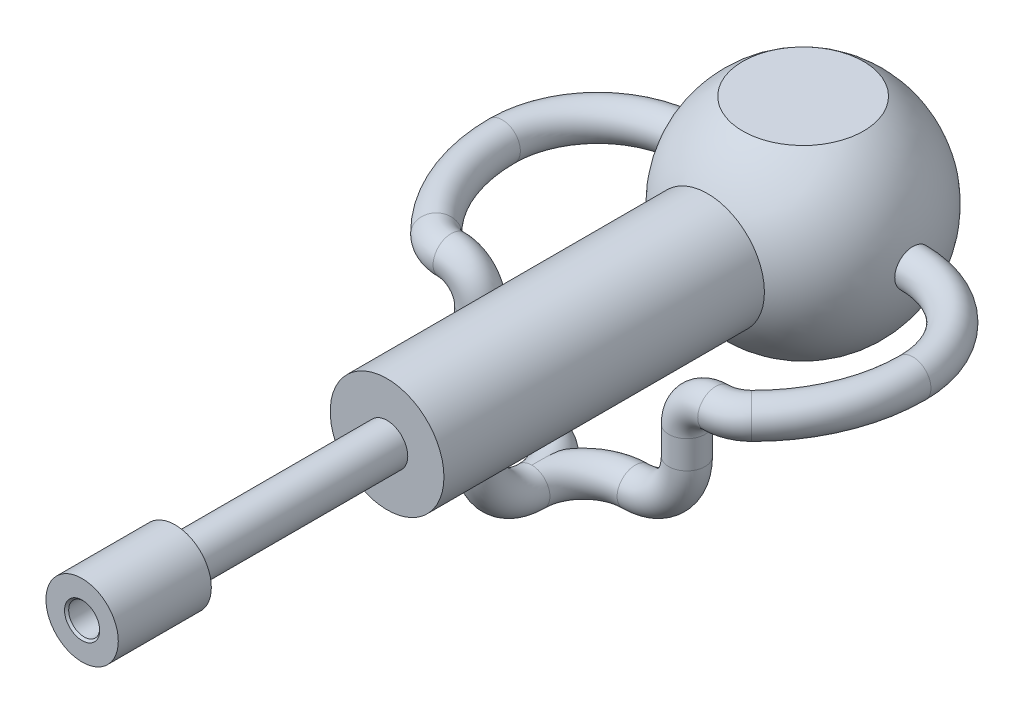
ISO-10303-21;
HEADER;
FILE_DESCRIPTION(('STEP AP214'),'2;1');
FILE_NAME('part.step','',(''),(''),'','','');
FILE_SCHEMA(('AUTOMOTIVE_DESIGN { 1 0 10303 214 1 1 1 1 }'));
ENDSEC;
DATA;
#1=APPLICATION_CONTEXT('core data for automotive mechanical design processes');
#2=APPLICATION_PROTOCOL_DEFINITION('international standard','automotive_design',2000,#1);
#3=PRODUCT_CONTEXT('',#1,'mechanical');
#4=PRODUCT('Part','Part','',(#3));
#5=PRODUCT_RELATED_PRODUCT_CATEGORY('part','',(#4));
#6=PRODUCT_DEFINITION_FORMATION('','',#4);
#7=PRODUCT_DEFINITION_CONTEXT('part definition',#1,'design');
#8=PRODUCT_DEFINITION('design','',#6,#7);
#9=PRODUCT_DEFINITION_SHAPE('','',#8);
#10=(LENGTH_UNIT() NAMED_UNIT(*) SI_UNIT(.MILLI.,.METRE.));
#11=(NAMED_UNIT(*) PLANE_ANGLE_UNIT() SI_UNIT($,.RADIAN.));
#12=(NAMED_UNIT(*) SI_UNIT($,.STERADIAN.) SOLID_ANGLE_UNIT());
#13=UNCERTAINTY_MEASURE_WITH_UNIT(LENGTH_MEASURE(1.E-05),#10,'distance_accuracy_value','');
#14=(GEOMETRIC_REPRESENTATION_CONTEXT(3) GLOBAL_UNCERTAINTY_ASSIGNED_CONTEXT((#13)) GLOBAL_UNIT_ASSIGNED_CONTEXT((#10,
#11,#12)) REPRESENTATION_CONTEXT('',''));
#15=CARTESIAN_POINT('',(0.,0.,0.));
#16=DIRECTION('',(0.,0.,1.));
#17=DIRECTION('',(1.,0.,0.));
#18=AXIS2_PLACEMENT_3D('',#15,#16,#17);
#19=CARTESIAN_POINT('',(1.05064370436022E-07,-0.164460827820359,0.565466681554165));
#20=DIRECTION('',(0.,0.,1.));
#21=DIRECTION('',(1.,0.,0.));
#22=AXIS2_PLACEMENT_3D('',#19,#20,#21);
#23=SPHERICAL_SURFACE('',#22,0.672265625);
#24=CARTESIAN_POINT('',(0.663308615436159,-0.164460827820359,0.565466681554165));
#25=DIRECTION('',(-1.,0.,0.));
#26=DIRECTION('',(0.,0.,1.));
#27=AXIS2_PLACEMENT_3D('',#24,#25,#26);
#28=CIRCLE('',#27,0.109375);
#29=CARTESIAN_POINT('',(0.663308615436159,-0.164460827820359,0.456091681554165));
#30=VERTEX_POINT('',#29);
#31=EDGE_CURVE('E111',#30,#30,#28,.T.);
#32=ORIENTED_EDGE('',*,*,#31,.T.);
#33=EDGE_LOOP('',(#32));
#34=FACE_BOUND('',#33,.T.);
#35=CARTESIAN_POINT('',(-0.663308405307418,-0.164460827820359,0.565466681554165));
#36=DIRECTION('',(1.,0.,0.));
#37=DIRECTION('',(0.,0.,-1.));
#38=AXIS2_PLACEMENT_3D('',#35,#36,#37);
#39=CIRCLE('',#38,0.109375);
#40=CARTESIAN_POINT('',(-0.663308405307418,-0.164460827820359,0.456091681554165));
#41=VERTEX_POINT('',#40);
#42=EDGE_CURVE('E106',#41,#41,#39,.T.);
#43=ORIENTED_EDGE('',*,*,#42,.T.);
#44=EDGE_LOOP('',(#43));
#45=FACE_BOUND('',#44,.T.);
#46=CARTESIAN_POINT('',(1.05064370436022E-07,-0.164460827820359,1.14320105655417));
#47=DIRECTION('',(0.,0.,1.));
#48=DIRECTION('',(1.,0.,0.));
#49=AXIS2_PLACEMENT_3D('',#46,#47,#48);
#50=CIRCLE('',#49,0.34375);
#51=CARTESIAN_POINT('',(0.34375010506437,-0.164460827820359,1.14320105655417));
#52=VERTEX_POINT('',#51);
#53=EDGE_CURVE('E110',#52,#52,#50,.T.);
#54=ORIENTED_EDGE('',*,*,#53,.F.);
#55=EDGE_LOOP('',(#54));
#56=FACE_BOUND('',#55,.T.);
#57=CARTESIAN_POINT('',(1.0506437030215E-07,0.4,0.565466681554165));
#58=DIRECTION('',(0.,1.,0.));
#59=DIRECTION('',(-1.,0.,0.));
#60=AXIS2_PLACEMENT_3D('',#57,#58,#59);
#61=CIRCLE('',#60,0.365137021422089);
#62=CARTESIAN_POINT('',(-0.365136916357718,0.4,0.565466681554165));
#63=VERTEX_POINT('',#62);
#64=EDGE_CURVE('E43',#63,#63,#61,.T.);
#65=ORIENTED_EDGE('',*,*,#64,.F.);
#66=EDGE_LOOP('',(#65));
#67=FACE_BOUND('',#66,.T.);
#68=ADVANCED_FACE('F39',(#34,#45,#56,#67),#23,.T.);
#69=CARTESIAN_POINT('',(1.05064370436022E-07,-0.164460827820359,4.92445105655417));
#70=DIRECTION('',(0.,0.,-1.));
#71=DIRECTION('',(-1.,0.,0.));
#72=AXIS2_PLACEMENT_3D('',#69,#70,#71);
#73=PLANE('',#72);
#74=CARTESIAN_POINT('',(1.05064370436022E-07,-0.164460827820359,4.92445105655417));
#75=DIRECTION('',(0.,0.,-1.));
#76=DIRECTION('',(-1.,0.,0.));
#77=AXIS2_PLACEMENT_3D('',#74,#75,#76);
#78=CIRCLE('',#77,0.106250000000002);
#79=CARTESIAN_POINT('',(-0.106249894935631,-0.164460827820359,4.92445105655417));
#80=VERTEX_POINT('',#79);
#81=EDGE_CURVE('E132',#80,#80,#78,.T.);
#82=ORIENTED_EDGE('',*,*,#81,.T.);
#83=EDGE_LOOP('',(#82));
#84=FACE_BOUND('',#83,.T.);
#85=CARTESIAN_POINT('',(1.05064370436022E-07,-0.164460827820359,4.92445105655417));
#86=DIRECTION('',(0.,0.,1.));
#87=DIRECTION('',(1.,0.,0.));
#88=AXIS2_PLACEMENT_3D('',#85,#86,#87);
#89=CIRCLE('',#88,0.21875);
#90=CARTESIAN_POINT('',(0.21875010506437,-0.164460827820359,4.92445105655417));
#91=VERTEX_POINT('',#90);
#92=EDGE_CURVE('E124',#91,#91,#89,.T.);
#93=ORIENTED_EDGE('',*,*,#92,.T.);
#94=EDGE_LOOP('',(#93));
#95=FACE_BOUND('',#94,.T.);
#96=ADVANCED_FACE('F173',(#84,#95),#73,.F.);
#97=CARTESIAN_POINT('',(1.05064370436022E-07,-0.164460827820359,4.78803672221191));
#98=DIRECTION('',(0.,0.,1.));
#99=DIRECTION('',(1.,0.,0.));
#100=AXIS2_PLACEMENT_3D('',#97,#98,#99);
#101=CYLINDRICAL_SURFACE('',#100,0.21875);
#102=ORIENTED_EDGE('',*,*,#92,.F.);
#103=EDGE_LOOP('',(#102));
#104=FACE_BOUND('',#103,.T.);
#105=CARTESIAN_POINT('',(1.05064370436022E-07,-0.164460827820359,4.36195105655417));
#106=DIRECTION('',(0.,0.,1.));
#107=DIRECTION('',(1.,0.,0.));
#108=AXIS2_PLACEMENT_3D('',#105,#106,#107);
#109=CIRCLE('',#108,0.21875);
#110=CARTESIAN_POINT('',(0.21875010506437,-0.164460827820359,4.36195105655417));
#111=VERTEX_POINT('',#110);
#112=EDGE_CURVE('E121',#111,#111,#109,.T.);
#113=ORIENTED_EDGE('',*,*,#112,.T.);
#114=EDGE_LOOP('',(#113));
#115=FACE_BOUND('',#114,.T.);
#116=ADVANCED_FACE('F180',(#104,#115),#101,.T.);
#117=CARTESIAN_POINT('',(1.05064370436022E-07,0.0542891721796406,4.36195105655417));
#118=DIRECTION('',(0.,0.,1.));
#119=DIRECTION('',(1.,0.,0.));
#120=AXIS2_PLACEMENT_3D('',#117,#118,#119);
#121=PLANE('',#120);
#122=ORIENTED_EDGE('',*,*,#112,.F.);
#123=EDGE_LOOP('',(#122));
#124=FACE_BOUND('',#123,.T.);
#125=CARTESIAN_POINT('',(1.05064370436022E-07,-0.164460827820359,4.36195105655417));
#126=DIRECTION('',(0.,0.,1.));
#127=DIRECTION('',(1.,0.,0.));
#128=AXIS2_PLACEMENT_3D('',#125,#126,#127);
#129=CIRCLE('',#128,0.125);
#130=CARTESIAN_POINT('',(0.12500010506437,-0.164460827820359,4.36195105655417));
#131=VERTEX_POINT('',#130);
#132=EDGE_CURVE('E118',#131,#131,#129,.T.);
#133=ORIENTED_EDGE('',*,*,#132,.T.);
#134=EDGE_LOOP('',(#133));
#135=FACE_BOUND('',#134,.T.);
#136=ADVANCED_FACE('F187',(#124,#135),#121,.F.);
#137=CARTESIAN_POINT('',(1.05064370436022E-07,-0.164460827820359,4.78803672221191));
#138=DIRECTION('',(0.,0.,1.));
#139=DIRECTION('',(1.,0.,0.));
#140=AXIS2_PLACEMENT_3D('',#137,#138,#139);
#141=CYLINDRICAL_SURFACE('',#140,0.125);
#142=ORIENTED_EDGE('',*,*,#132,.F.);
#143=EDGE_LOOP('',(#142));
#144=FACE_BOUND('',#143,.T.);
#145=CARTESIAN_POINT('',(1.05064370436022E-07,-0.164460827820359,3.08070105655416));
#146=DIRECTION('',(0.,0.,1.));
#147=DIRECTION('',(1.,0.,0.));
#148=AXIS2_PLACEMENT_3D('',#145,#146,#147);
#149=CIRCLE('',#148,0.125);
#150=CARTESIAN_POINT('',(0.12500010506437,-0.164460827820359,3.08070105655416));
#151=VERTEX_POINT('',#150);
#152=EDGE_CURVE('E115',#151,#151,#149,.T.);
#153=ORIENTED_EDGE('',*,*,#152,.T.);
#154=EDGE_LOOP('',(#153));
#155=FACE_BOUND('',#154,.T.);
#156=ADVANCED_FACE('F191',(#144,#155),#141,.T.);
#157=CARTESIAN_POINT('',(1.05064370436022E-07,-0.0394608278203594,3.08070105655416));
#158=DIRECTION('',(0.,0.,-1.));
#159=DIRECTION('',(-1.,0.,0.));
#160=AXIS2_PLACEMENT_3D('',#157,#158,#159);
#161=PLANE('',#160);
#162=ORIENTED_EDGE('',*,*,#152,.F.);
#163=EDGE_LOOP('',(#162));
#164=FACE_BOUND('',#163,.T.);
#165=CARTESIAN_POINT('',(1.05064370436022E-07,-0.164460827820359,3.08070105655417));
#166=DIRECTION('',(0.,0.,1.));
#167=DIRECTION('',(1.,0.,0.));
#168=AXIS2_PLACEMENT_3D('',#165,#166,#167);
#169=CIRCLE('',#168,0.34375);
#170=CARTESIAN_POINT('',(0.34375010506437,-0.164460827820359,3.08070105655417));
#171=VERTEX_POINT('',#170);
#172=EDGE_CURVE('E112',#171,#171,#169,.T.);
#173=ORIENTED_EDGE('',*,*,#172,.T.);
#174=EDGE_LOOP('',(#173));
#175=FACE_BOUND('',#174,.T.);
#176=ADVANCED_FACE('F170',(#164,#175),#161,.F.);
#177=CARTESIAN_POINT('',(1.05064370436022E-07,-0.164460827820359,4.78803672221191));
#178=DIRECTION('',(0.,0.,1.));
#179=DIRECTION('',(1.,0.,0.));
#180=AXIS2_PLACEMENT_3D('',#177,#178,#179);
#181=CYLINDRICAL_SURFACE('',#180,0.34375);
#182=CARTESIAN_POINT('',(1.05064370544443E-07,-0.508210827820359,2.62757605655416));
#183=CARTESIAN_POINT('',(0.00598303984569434,-0.508210809314324,2.62757603430133));
#184=CARTESIAN_POINT('',(0.0119662310705951,-0.508053163825251,2.62708353425574));
#185=CARTESIAN_POINT('',(0.0237573004650308,-0.507439751280318,2.62513193991619));
#186=CARTESIAN_POINT('',(0.0295651445347719,-0.506983926623219,2.62367265886206));
#187=CARTESIAN_POINT('',(0.0408337997887642,-0.505823880513206,2.61984193764445));
#188=CARTESIAN_POINT('',(0.0462951438951128,-0.505120051987797,2.61747193984979));
#189=CARTESIAN_POINT('',(0.0567428952640561,-0.503536445929278,2.61189330003404));
#190=CARTESIAN_POINT('',(0.0617292222688804,-0.50265663874079,2.60868451663539));
#191=CARTESIAN_POINT('',(0.0712444445798483,-0.500782866936331,2.60141172726519));
#192=CARTESIAN_POINT('',(0.0757560722031934,-0.499786347936233,2.59732579040216));
#193=CARTESIAN_POINT('',(0.0840429947828927,-0.497806060289349,2.58846135492482));
#194=CARTESIAN_POINT('',(0.0878181462143406,-0.496822294162654,2.58368272163307));
#195=CARTESIAN_POINT('',(0.094619891641243,-0.49495130493495,2.5734174664084));
#196=CARTESIAN_POINT('',(0.0976246813930201,-0.494067224131992,2.56791576970319));
#197=CARTESIAN_POINT('',(0.102659139989088,-0.492534235893732,2.55645245948561));
#198=CARTESIAN_POINT('',(0.104689076447975,-0.491885263928896,2.55049097271597));
#199=CARTESIAN_POINT('',(0.107652594553159,-0.490922738768963,2.53847257980932));
#200=CARTESIAN_POINT('',(0.108618296702573,-0.490599385622248,2.53242440109462));
#201=CARTESIAN_POINT('',(0.109526301464399,-0.490295640876687,2.52024388795449));
#202=CARTESIAN_POINT('',(0.10946888768041,-0.490315154236612,2.51411157732104));
#203=CARTESIAN_POINT('',(0.108357363700124,-0.490686304284026,2.5022047318982));
#204=CARTESIAN_POINT('',(0.10734436936993,-0.49102423952497,2.49642585928572));
#205=CARTESIAN_POINT('',(0.104417212497437,-0.491971854935255,2.48512478217646));
#206=CARTESIAN_POINT('',(0.102502950970303,-0.492581564952824,2.47960260594549));
#207=CARTESIAN_POINT('',(0.0977991357720019,-0.49401433265152,2.46887494498681));
#208=CARTESIAN_POINT('',(0.0949968674972209,-0.494840457162081,2.46367546251914));
#209=CARTESIAN_POINT('',(0.0886054133330968,-0.496611597497984,2.45380717302383));
#210=CARTESIAN_POINT('',(0.0850160167817436,-0.497556645122241,2.44913850856986));
#211=CARTESIAN_POINT('',(0.0769515822805177,-0.499513832459101,2.44023230320584));
#212=CARTESIAN_POINT('',(0.0724426877815944,-0.50052703143577,2.43602559357386));
#213=CARTESIAN_POINT('',(0.0627708579123458,-0.502467026756537,2.42842037284144));
#214=CARTESIAN_POINT('',(0.0576078705186206,-0.503393816217848,2.42502192608826));
#215=CARTESIAN_POINT('',(0.0467134071689632,-0.505066923105735,2.41910777676812));
#216=CARTESIAN_POINT('',(0.040977550955914,-0.505811671672495,2.4165996691189));
#217=CARTESIAN_POINT('',(0.029136086729071,-0.507025444624355,2.41259320241253));
#218=CARTESIAN_POINT('',(0.0230305959450025,-0.507494555927837,2.41109452502373));
#219=CARTESIAN_POINT('',(0.0108846928950979,-0.508090101408693,2.40920253962321));
#220=CARTESIAN_POINT('',(0.00485140340050993,-0.508229461140912,2.40876751467981));
#221=CARTESIAN_POINT('',(-0.00720274933203243,-0.508188172807526,2.40889723836461));
#222=CARTESIAN_POINT('',(-0.0132236143200736,-0.508007573400697,2.40946183497226));
#223=CARTESIAN_POINT('',(-0.0249194840768429,-0.507355164599867,2.41154140643275));
#224=CARTESIAN_POINT('',(-0.0305994090807456,-0.506891030377936,2.41303134966571));
#225=CARTESIAN_POINT('',(-0.0416268922456449,-0.505726157685043,2.41688857644746));
#226=CARTESIAN_POINT('',(-0.0469744088352919,-0.505025389690617,2.41925596947433));
#227=CARTESIAN_POINT('',(-0.0573336100904289,-0.503437332532959,2.42486671903969));
#228=CARTESIAN_POINT('',(-0.062333602160849,-0.502545829733564,2.42813043797291));
#229=CARTESIAN_POINT('',(-0.0717288248223086,-0.500678027708714,2.43541690418187));
#230=CARTESIAN_POINT('',(-0.0761238851305091,-0.499701704732785,2.43943986442462));
#231=CARTESIAN_POINT('',(-0.0843724603848329,-0.497723606046521,2.44832686554566));
#232=CARTESIAN_POINT('',(-0.0881962268779313,-0.496722437499465,2.45321871691878));
#233=CARTESIAN_POINT('',(-0.0949715273059874,-0.494849764698745,2.46359635947694));
#234=CARTESIAN_POINT('',(-0.0979230701349862,-0.493978259122955,2.46908214460485));
#235=CARTESIAN_POINT('',(-0.102852861973881,-0.492473008395913,2.48048389431681));
#236=CARTESIAN_POINT('',(-0.104834457155228,-0.491838447644261,2.48639829797114));
#237=CARTESIAN_POINT('',(-0.107766024821676,-0.490885315618962,2.49850130797762));
#238=CARTESIAN_POINT('',(-0.108716408644071,-0.49056661835572,2.50468980397177));
#239=CARTESIAN_POINT('',(-0.109528335342008,-0.490294751965392,2.51685341382887));
#240=CARTESIAN_POINT('',(-0.109438829524218,-0.490325148924816,2.52282493216092));
#241=CARTESIAN_POINT('',(-0.10829230385966,-0.490707932986846,2.5346633032253));
#242=CARTESIAN_POINT('',(-0.107235332303799,-0.491060304018164,2.54053016116684));
#243=CARTESIAN_POINT('',(-0.104217167482259,-0.492035642875321,2.55190160563404));
#244=CARTESIAN_POINT('',(-0.102270472210648,-0.492654263102148,2.5574104415092));
#245=CARTESIAN_POINT('',(-0.0975396139393377,-0.494091149720119,2.56802766436749));
#246=CARTESIAN_POINT('',(-0.0947552761879226,-0.494909457764055,2.57313596750956));
#247=CARTESIAN_POINT('',(-0.0882968457074477,-0.496694707632584,2.58303033391932));
#248=CARTESIAN_POINT('',(-0.08459138303011,-0.497666314720448,2.58779507612219));
#249=CARTESIAN_POINT('',(-0.0764505032895494,-0.499627761923312,2.59665096857009));
#250=CARTESIAN_POINT('',(-0.0720148881006319,-0.500617606922219,2.60074193538285));
#251=CARTESIAN_POINT('',(-0.062356661304602,-0.502544736563667,2.60827487731381));
#252=CARTESIAN_POINT('',(-0.0571122750792523,-0.503479054068333,2.61168978077238));
#253=CARTESIAN_POINT('',(-0.046094238156847,-0.505151820514681,2.61758517846607));
#254=CARTESIAN_POINT('',(-0.0403207774944798,-0.505890339415765,2.62006600658245));
#255=CARTESIAN_POINT('',(-0.0288490983345537,-0.507042970825001,2.62386267244394));
#256=CARTESIAN_POINT('',(-0.0231768589358052,-0.507477026362722,2.62525106431161));
#257=CARTESIAN_POINT('',(-0.0116697685496835,-0.508060932552662,2.62710766577258));
#258=CARTESIAN_POINT('',(-0.00583495370443864,-0.508210845868994,2.62757607825699));
#259=CARTESIAN_POINT('',(1.05064370544443E-07,-0.508210827820359,2.62757605655416));
#260=B_SPLINE_CURVE_WITH_KNOTS('',3,(#182,#183,#184,#185,#186,#187,#188,#189,#190,#191,#192,
#193,#194,#195,#196,#197,#198,#199,#200,#201,#202,#203,#204,#205,#206,#207,#208,#209,#210,#211,
#212,#213,#214,#215,#216,#217,#218,#219,#220,#221,#222,#223,#224,#225,#226,#227,#228,#229,#230,
#231,#232,#233,#234,#235,#236,#237,#238,#239,#240,#241,#242,#243,#244,#245,#246,#247,#248,#249,
#250,#251,#252,#253,#254,#255,#256,#257,#258,#259),.UNSPECIFIED.,.T.,.F.,(4,2,2,2,2,2,2,2,2,2,2,
2,2,2,2,2,2,2,2,2,2,2,2,2,2,2,2,2,2,2,2,2,2,2,2,2,2,2,4),(0.,0.0179273499031664,
0.0358581639740354,0.0537606959726669,0.071666247396112,0.0900864633618759,0.108510265491847,
0.127408983149715,0.146302509803084,0.164608696220462,0.182909808315975,0.200457745789963,
0.218007610977539,0.235821065993434,0.253639294320338,0.272300201903445,0.29096259461818,
0.309780561168541,0.328592590545441,0.346654046611208,0.364712756160982,0.382303043054482,
0.399895525400373,0.417926494808312,0.43596252943655,0.454741178279767,0.473519635631004,
0.492232845388494,0.510938587933811,0.528767496309064,0.546595514805563,0.564142850268301,
0.581693849055225,0.59995307228384,0.618217258315011,0.637107871799357,0.655991726489083,
0.673479835867995,0.690964088008018),.UNSPECIFIED.);
#261=CARTESIAN_POINT('',(1.0506437049221E-07,-0.50821082782036,2.40882605655416));
#262=VERTEX_POINT('',#261);
#263=CARTESIAN_POINT('',(1.05064370544443E-07,-0.508210827820359,2.62757605655416));
#264=VERTEX_POINT('',#263);
#265=EDGE_CURVE('E135',#262,#264,#260,.T.);
#266=ORIENTED_EDGE('',*,*,#265,.T.);
#267=EDGE_CURVE('E48',#264,#262,#260,.T.);
#268=ORIENTED_EDGE('',*,*,#267,.T.);
#269=EDGE_LOOP('',(#266,#268));
#270=FACE_BOUND('',#269,.T.);
#271=ORIENTED_EDGE('',*,*,#172,.F.);
#272=EDGE_LOOP('',(#271));
#273=FACE_BOUND('',#272,.T.);
#274=ORIENTED_EDGE('',*,*,#53,.T.);
#275=EDGE_LOOP('',(#274));
#276=FACE_BOUND('',#275,.T.);
#277=ADVANCED_FACE('F150',(#270,#273,#276),#181,.T.);
#278=CARTESIAN_POINT('',(1.05064370436022E-07,-0.0394608278203594,3.08070105655416));
#279=DIRECTION('',(0.,0.,-1.));
#280=DIRECTION('',(-1.,0.,0.));
#281=AXIS2_PLACEMENT_3D('',#278,#279,#280);
#282=PLANE('',#281);
#283=CARTESIAN_POINT('',(1.05064370436022E-07,-0.164460827820359,3.08070105655416));
#284=DIRECTION('',(0.,0.,-1.));
#285=DIRECTION('',(-1.,0.,0.));
#286=AXIS2_PLACEMENT_3D('',#283,#284,#285);
#287=CIRCLE('',#286,0.09375);
#288=CARTESIAN_POINT('',(-0.0937498949356296,-0.164460827820359,3.08070105655416));
#289=VERTEX_POINT('',#288);
#290=EDGE_CURVE('E107',#289,#289,#287,.F.);
#291=ORIENTED_EDGE('',*,*,#290,.T.);
#292=EDGE_LOOP('',(#291));
#293=FACE_BOUND('',#292,.T.);
#294=ADVANCED_FACE('F163',(#293),#282,.F.);
#295=CARTESIAN_POINT('',(1.05064370436022E-07,-0.164460827820359,2.81553601360921));
#296=DIRECTION('',(0.,0.,1.));
#297=DIRECTION('',(1.,0.,0.));
#298=AXIS2_PLACEMENT_3D('',#295,#296,#297);
#299=CYLINDRICAL_SURFACE('',#298,0.09375);
#300=CARTESIAN_POINT('',(1.05064370436022E-07,-0.164460827820359,4.91195105655416));
#301=DIRECTION('',(0.,0.,-1.));
#302=DIRECTION('',(-1.,0.,0.));
#303=AXIS2_PLACEMENT_3D('',#300,#301,#302);
#304=CIRCLE('',#303,0.09375);
#305=CARTESIAN_POINT('',(-0.0937498949356296,-0.164460827820359,4.91195105655416));
#306=VERTEX_POINT('',#305);
#307=EDGE_CURVE('E127',#306,#306,#304,.F.);
#308=ORIENTED_EDGE('',*,*,#307,.T.);
#309=EDGE_LOOP('',(#308));
#310=FACE_BOUND('',#309,.T.);
#311=ORIENTED_EDGE('',*,*,#290,.F.);
#312=EDGE_LOOP('',(#311));
#313=FACE_BOUND('',#312,.T.);
#314=ADVANCED_FACE('F161',(#310,#313),#299,.F.);
#315=CARTESIAN_POINT('',(1.05064370436022E-07,-0.164460827820359,4.91195105655416));
#316=DIRECTION('',(0.,0.,1.));
#317=DIRECTION('',(1.,0.,0.));
#318=AXIS2_PLACEMENT_3D('',#315,#316,#317);
#319=CONICAL_SURFACE('',#318,0.09375,0.785398163397451);
#320=ORIENTED_EDGE('',*,*,#81,.F.);
#321=EDGE_LOOP('',(#320));
#322=FACE_BOUND('',#321,.T.);
#323=ORIENTED_EDGE('',*,*,#307,.F.);
#324=EDGE_LOOP('',(#323));
#325=FACE_BOUND('',#324,.T.);
#326=ADVANCED_FACE('F41',(#322,#325),#319,.F.);
#327=CARTESIAN_POINT('',(1.05064370544443E-07,-0.508210827820359,2.20570105655416));
#328=DIRECTION('',(-1.,0.,0.));
#329=DIRECTION('',(0.,0.,1.));
#330=AXIS2_PLACEMENT_3D('',#327,#328,#329);
#331=TOROIDAL_SURFACE('',#330,0.3125,0.109375);
#332=CARTESIAN_POINT('',(1.05064370544443E-07,-0.50821082782036,2.51820105655416));
#333=DIRECTION('',(0.,1.,0.));
#334=DIRECTION('',(1.,0.,0.));
#335=AXIS2_PLACEMENT_3D('',#332,#333,#334);
#336=CIRCLE('',#335,0.109375);
#337=EDGE_CURVE('E54',#262,#264,#336,.T.);
#338=ORIENTED_EDGE('',*,*,#337,.F.);
#339=EDGE_CURVE('E60',#264,#262,#336,.T.);
#340=ORIENTED_EDGE('',*,*,#339,.F.);
#341=EDGE_LOOP('',(#338,#340));
#342=FACE_BOUND('',#341,.T.);
#343=CARTESIAN_POINT('',(1.05064370544443E-07,-0.820710827820359,2.20570105655416));
#344=DIRECTION('',(0.,0.,1.));
#345=DIRECTION('',(1.,0.,0.));
#346=AXIS2_PLACEMENT_3D('',#343,#344,#345);
#347=CIRCLE('',#346,0.109375);
#348=CARTESIAN_POINT('',(1.05064370490232E-07,-0.930085827820359,2.20570105655416));
#349=VERTEX_POINT('',#348);
#350=CARTESIAN_POINT('',(1.05064370490232E-07,-0.711335827820359,2.20570105655416));
#351=VERTEX_POINT('',#350);
#352=EDGE_CURVE('E69',#349,#351,#347,.T.);
#353=ORIENTED_EDGE('',*,*,#352,.T.);
#354=CARTESIAN_POINT('',(1.05064370327602E-07,-0.820710827820359,2.20570105655416));
#355=DIRECTION('',(0.,0.,-1.));
#356=DIRECTION('',(-1.,0.,0.));
#357=AXIS2_PLACEMENT_3D('',#354,#355,#356);
#358=CIRCLE('',#357,0.109375);
#359=EDGE_CURVE('E79',#351,#349,#358,.F.);
#360=ORIENTED_EDGE('',*,*,#359,.T.);
#361=EDGE_LOOP('',(#353,#360));
#362=FACE_BOUND('',#361,.T.);
#363=ADVANCED_FACE('F80',(#342,#362),#331,.T.);
#364=CARTESIAN_POINT('',(0.31250010506437,-0.820710827820359,2.20570105655416));
#365=DIRECTION('',(0.,1.,0.));
#366=DIRECTION('',(0.,0.,1.));
#367=AXIS2_PLACEMENT_3D('',#364,#365,#366);
#368=TOROIDAL_SURFACE('',#367,0.3125,0.109375);
#369=CARTESIAN_POINT('',(1.05064370490232E-07,-0.711335827820359,2.20570105655416));
#370=CARTESIAN_POINT('',(1.05064370491836E-07,-0.711336517213383,2.20275477417994));
#371=CARTESIAN_POINT('',(1.05064370491671E-07,-0.711336262628981,2.19980849658866));
#372=CARTESIAN_POINT('',(1.05064370484041E-07,-0.711334334903013,2.18417977815892));
#373=CARTESIAN_POINT('',(1.05064370454269E-07,-0.711330754147986,2.17149738626135));
#374=CARTESIAN_POINT('',(1.05064370426827E-07,-0.711452820417087,2.14612494579156));
#375=CARTESIAN_POINT('',(1.05064370429175E-07,-0.711578543277819,2.13343489709365));
#376=CARTESIAN_POINT('',(1.05064370389005E-07,-0.71227256880364,2.10805194668773));
#377=CARTESIAN_POINT('',(1.05064370346448E-07,-0.712841255317803,2.09535905205496));
#378=CARTESIAN_POINT('',(1.05064370388354E-07,-0.714866603006251,2.0700472099792));
#379=CARTESIAN_POINT('',(1.05064370472654E-07,-0.716322132035381,2.05742818893172));
#380=CARTESIAN_POINT('',(1.05064370450438E-07,-0.72071951462946,2.03217961241358));
#381=CARTESIAN_POINT('',(1.05064370340181E-07,-0.723689715283137,2.01955462206217));
#382=CARTESIAN_POINT('',(1.05064370367831E-07,-0.731844079703336,1.99506095956259));
#383=CARTESIAN_POINT('',(1.0506437050376E-07,-0.737010333597016,1.98318704288903));
#384=CARTESIAN_POINT('',(1.05064370443551E-07,-0.746486963477968,1.96746612603929));
#385=CARTESIAN_POINT('',(1.05064370392544E-07,-0.749606199489989,1.96290213837501));
#386=CARTESIAN_POINT('',(1.05064370398943E-07,-0.75643683895736,1.95422600325332));
#387=CARTESIAN_POINT('',(1.05064370456443E-07,-0.76014875567088,1.95011425269102));
#388=CARTESIAN_POINT('',(1.05064370466914E-07,-0.768217633472304,1.94248381944982));
#389=CARTESIAN_POINT('',(1.05064370418846E-07,-0.772580609576911,1.93897140273746));
#390=CARTESIAN_POINT('',(1.05064370426363E-07,-0.781878771714722,1.93280953063883));
#391=CARTESIAN_POINT('',(1.05064370481746E-07,-0.786812827470623,1.93015840889294));
#392=CARTESIAN_POINT('',(1.05064370446296E-07,-0.795905549881156,1.92642893259219));
#393=CARTESIAN_POINT('',(1.05064370386849E-07,-0.799972879242576,1.92512716112027));
#394=CARTESIAN_POINT('',(1.05064370388826E-07,-0.808269128578567,1.92322568746526));
#395=CARTESIAN_POINT('',(1.0506437045019E-07,-0.812497966192426,1.92262563225259));
#396=CARTESIAN_POINT('',(1.05064370473136E-07,-0.82100321102857,1.92216635912771));
#397=CARTESIAN_POINT('',(1.05064370434548E-07,-0.825279686930362,1.92230840310088));
#398=CARTESIAN_POINT('',(1.05064370433756E-07,-0.833743892771172,1.92332646517129));
#399=CARTESIAN_POINT('',(1.05064370471563E-07,-0.837931610673106,1.92420258217645));
#400=CARTESIAN_POINT('',(1.05064370451942E-07,-0.846021100093849,1.92660863736791));
#401=CARTESIAN_POINT('',(1.05064370396404E-07,-0.849926915502781,1.92812514839519));
#402=CARTESIAN_POINT('',(1.05064370394146E-07,-0.857464347857287,1.93172781446775));
#403=CARTESIAN_POINT('',(1.05064370447468E-07,-0.861095856432625,1.93381419316325));
#404=CARTESIAN_POINT('',(1.05064370481197E-07,-0.86934924295656,1.93934534197185));
#405=CARTESIAN_POINT('',(1.05064370426446E-07,-0.873826950635668,1.94300551806781));
#406=CARTESIAN_POINT('',(1.05064370414562E-07,-0.882128268513786,1.95100349603088));
#407=CARTESIAN_POINT('',(1.05064370457615E-07,-0.885950620258294,1.95534257168393));
#408=CARTESIAN_POINT('',(1.05064370467463E-07,-0.894496576656854,1.96651337299823));
#409=CARTESIAN_POINT('',(1.05064370392533E-07,-0.89888025491693,1.97360371521713));
#410=CARTESIAN_POINT('',(1.05064370377445E-07,-0.906494687071849,1.98836823932578));
#411=CARTESIAN_POINT('',(1.05064370437499E-07,-0.909723612591712,1.99604332396611));
#412=CARTESIAN_POINT('',(1.05064370515074E-07,-0.918582678750302,2.02120952999154));
#413=CARTESIAN_POINT('',(1.05064370392882E-07,-0.922381531726188,2.03932592943666));
#414=CARTESIAN_POINT('',(1.05064370359101E-07,-0.927396153209426,2.07589256909272));
#415=CARTESIAN_POINT('',(1.0506437044883E-07,-0.928595654714044,2.09434418708704));
#416=CARTESIAN_POINT('',(1.05064370471388E-07,-0.929742893168675,2.12683029591982));
#417=CARTESIAN_POINT('',(1.05064370436797E-07,-0.929922509418737,2.14085847375176));
#418=CARTESIAN_POINT('',(1.05064370412458E-07,-0.930094845888898,2.16887843910734));
#419=CARTESIAN_POINT('',(1.05064370422598E-07,-0.930088036588094,2.18287022913147));
#420=CARTESIAN_POINT('',(1.05064370469877E-07,-0.93008527628976,2.19980848889303));
#421=CARTESIAN_POINT('',(1.05064370479383E-07,-0.930084996976059,2.20275476498129));
#422=CARTESIAN_POINT('',(1.05064370490232E-07,-0.930085827820359,2.20570105655416));
#423=B_SPLINE_CURVE_WITH_KNOTS('',3,(#369,#370,#371,#372,#373,#374,#375,#376,#377,#378,#379,
#380,#381,#382,#383,#384,#385,#386,#387,#388,#389,#390,#391,#392,#393,#394,#395,#396,#397,#398,
#399,#400,#401,#402,#403,#404,#405,#406,#407,#408,#409,#410,#411,#412,#413,#414,#415,#416,#417,
#418,#419,#420,#421,#422),.UNSPECIFIED.,.F.,.F.,(4,2,2,2,2,2,2,2,2,2,2,2,2,2,2,2,2,2,2,2,2,2,2,
2,2,2,4),(0.,0.00883883476512046,0.0468862102823564,0.0849559133276915,0.123058642331658,
0.161112830925739,0.199906872900712,0.238390424018514,0.254934723738751,0.271493429221584,
0.288215859695346,0.304905741662187,0.317661952430154,0.330411742854108,0.343183220413016,
0.355956419058516,0.368474148379469,0.380996797483629,0.398250476898998,0.415536925573206,
0.440404577920303,0.465311431877684,0.520398274541947,0.575828872453329,0.617911201972519,
0.659887338821181,0.668726173586301),.UNSPECIFIED.);
#424=EDGE_CURVE('E11',#351,#349,#423,.T.);
#425=ORIENTED_EDGE('',*,*,#424,.F.);
#426=ORIENTED_EDGE('',*,*,#352,.F.);
#427=EDGE_LOOP('',(#425,#426));
#428=FACE_BOUND('',#427,.T.);
#429=CARTESIAN_POINT('',(0.31250010506437,-0.820710827820359,1.89320105655417));
#430=DIRECTION('',(-1.,0.,0.));
#431=DIRECTION('',(0.,0.,1.));
#432=AXIS2_PLACEMENT_3D('',#429,#430,#431);
#433=CIRCLE('',#432,0.109375);
#434=CARTESIAN_POINT('',(0.31250010506437,-0.93008582782036,1.89320105655417));
#435=VERTEX_POINT('',#434);
#436=EDGE_CURVE('E74',#435,#435,#433,.T.);
#437=ORIENTED_EDGE('',*,*,#436,.T.);
#438=EDGE_LOOP('',(#437));
#439=FACE_BOUND('',#438,.T.);
#440=ADVANCED_FACE('F70',(#428,#439),#368,.T.);
#441=CARTESIAN_POINT('',(0.31250010506437,-0.50821082782036,1.89320105655417));
#442=DIRECTION('',(0.,0.,-1.));
#443=DIRECTION('',(-1.,0.,0.));
#444=AXIS2_PLACEMENT_3D('',#441,#442,#443);
#445=TOROIDAL_SURFACE('',#444,0.3125,0.109375);
#446=CARTESIAN_POINT('',(0.625000105064371,-0.50821082782036,1.89320105655417));
#447=DIRECTION('',(0.,-1.,0.));
#448=DIRECTION('',(0.,0.,1.));
#449=AXIS2_PLACEMENT_3D('',#446,#447,#448);
#450=CIRCLE('',#449,0.109375);
#451=CARTESIAN_POINT('',(0.73437510506437,-0.50821082782036,1.89320105655417));
#452=VERTEX_POINT('',#451);
#453=EDGE_CURVE('E100',#452,#452,#450,.T.);
#454=CARTESIAN_POINT('',(0.31250010506437,-0.50821082782036,1.89320105655417));
#455=DIRECTION('',(0.,0.,-1.));
#456=DIRECTION('',(-1.,0.,0.));
#457=AXIS2_PLACEMENT_3D('',#454,#455,#456);
#458=CIRCLE('',#457,0.421875);
#459=EDGE_CURVE('',#452,#435,#458,.T.);
#460=ORIENTED_EDGE('',*,*,#453,.T.);
#461=ORIENTED_EDGE('',*,*,#436,.F.);
#462=ORIENTED_EDGE('',*,*,#459,.T.);
#463=ORIENTED_EDGE('',*,*,#459,.F.);
#464=EDGE_LOOP('',(#460,#462,#461,#463));
#465=FACE_BOUND('',#464,.T.);
#466=ADVANCED_FACE('F282',(#465),#445,.T.);
#467=CARTESIAN_POINT('',(0.625000105064371,-0.33946082782036,1.89320105655417));
#468=DIRECTION('',(0.,-1.,0.));
#469=DIRECTION('',(0.,0.,-1.));
#470=AXIS2_PLACEMENT_3D('',#467,#468,#469);
#471=CYLINDRICAL_SURFACE('',#470,0.109375);
#472=ORIENTED_EDGE('',*,*,#453,.F.);
#473=EDGE_LOOP('',(#472));
#474=FACE_BOUND('',#473,.T.);
#475=CARTESIAN_POINT('',(0.625000105064371,-0.33946082782036,1.89320105655417));
#476=DIRECTION('',(0.,-1.,0.));
#477=DIRECTION('',(0.,0.,1.));
#478=AXIS2_PLACEMENT_3D('',#475,#476,#477);
#479=CIRCLE('',#478,0.109375);
#480=CARTESIAN_POINT('',(0.515625105064371,-0.33946082782036,1.89320105655417));
#481=VERTEX_POINT('',#480);
#482=EDGE_CURVE('E97',#481,#481,#479,.T.);
#483=ORIENTED_EDGE('',*,*,#482,.T.);
#484=EDGE_LOOP('',(#483));
#485=FACE_BOUND('',#484,.T.);
#486=ADVANCED_FACE('F278',(#474,#485),#471,.T.);
#487=CARTESIAN_POINT('',(0.800000105064371,-0.33946082782036,1.89320105655417));
#488=DIRECTION('',(0.,0.,1.));
#489=DIRECTION('',(1.,0.,0.));
#490=AXIS2_PLACEMENT_3D('',#487,#488,#489);
#491=TOROIDAL_SURFACE('',#490,0.175,0.109375);
#492=CARTESIAN_POINT('',(0.800000105064371,-0.164460827820359,1.89320105655417));
#493=DIRECTION('',(-1.,0.,0.));
#494=DIRECTION('',(0.,0.,1.));
#495=AXIS2_PLACEMENT_3D('',#492,#493,#494);
#496=CIRCLE('',#495,0.109375);
#497=CARTESIAN_POINT('',(0.800000105064371,-0.0550858278203596,1.89320105655417));
#498=VERTEX_POINT('',#497);
#499=EDGE_CURVE('E94',#498,#498,#496,.T.);
#500=CARTESIAN_POINT('',(0.800000105064371,-0.33946082782036,1.89320105655417));
#501=DIRECTION('',(0.,0.,1.));
#502=DIRECTION('',(1.,0.,0.));
#503=AXIS2_PLACEMENT_3D('',#500,#501,#502);
#504=CIRCLE('',#503,0.284375);
#505=EDGE_CURVE('',#498,#481,#504,.T.);
#506=ORIENTED_EDGE('',*,*,#499,.T.);
#507=ORIENTED_EDGE('',*,*,#482,.F.);
#508=ORIENTED_EDGE('',*,*,#505,.T.);
#509=ORIENTED_EDGE('',*,*,#505,.F.);
#510=EDGE_LOOP('',(#506,#508,#507,#509));
#511=FACE_BOUND('',#510,.T.);
#512=ADVANCED_FACE('F274',(#511),#491,.T.);
#513=CARTESIAN_POINT('',(0.800000105064371,-0.164460827820359,1.67445105655416));
#514=DIRECTION('',(0.,-1.,0.));
#515=DIRECTION('',(0.,0.,-1.));
#516=AXIS2_PLACEMENT_3D('',#513,#514,#515);
#517=TOROIDAL_SURFACE('',#516,0.21875,0.109375);
#518=ORIENTED_EDGE('',*,*,#499,.F.);
#519=EDGE_LOOP('',(#518));
#520=FACE_BOUND('',#519,.T.);
#521=CARTESIAN_POINT('',(0.953563048093194,-0.164460827820359,1.83023932642172));
#522=DIRECTION('',(-0.71217494796597,0.,0.70200202527462));
#523=DIRECTION('',(0.702002025274619,0.,0.71217494796597));
#524=AXIS2_PLACEMENT_3D('',#521,#522,#523);
#525=CIRCLE('',#524,0.109375);
#526=CARTESIAN_POINT('',(1.03034451960761,-0.164460827820359,1.9081334613555));
#527=VERTEX_POINT('',#526);
#528=EDGE_CURVE('E85',#527,#527,#525,.T.);
#529=ORIENTED_EDGE('',*,*,#528,.T.);
#530=EDGE_LOOP('',(#529));
#531=FACE_BOUND('',#530,.T.);
#532=ADVANCED_FACE('F270',(#520,#531),#517,.T.);
#533=CARTESIAN_POINT('',(0.276338640992538,-0.164460827820359,1.14320105655417));
#534=DIRECTION('',(0.,-1.,0.));
#535=DIRECTION('',(0.,0.,-1.));
#536=AXIS2_PLACEMENT_3D('',#533,#534,#535);
#537=TOROIDAL_SURFACE('',#536,0.964704349443621,0.109375);
#538=CARTESIAN_POINT('',(1.24104299043616,-0.164460827820359,1.14320105655417));
#539=DIRECTION('',(0.,0.,1.));
#540=DIRECTION('',(1.,0.,0.));
#541=AXIS2_PLACEMENT_3D('',#538,#539,#540);
#542=CIRCLE('',#541,0.109375);
#543=CARTESIAN_POINT('',(1.35041799043616,-0.164460827820359,1.14320105655417));
#544=VERTEX_POINT('',#543);
#545=EDGE_CURVE('E81',#544,#544,#542,.T.);
#546=CARTESIAN_POINT('',(0.276338640992538,-0.164460827820359,1.14320105655417));
#547=DIRECTION('',(0.,-1.,0.));
#548=DIRECTION('',(0.,0.,-1.));
#549=AXIS2_PLACEMENT_3D('',#546,#547,#548);
#550=CIRCLE('',#549,1.07407934944362);
#551=EDGE_CURVE('',#544,#527,#550,.T.);
#552=ORIENTED_EDGE('',*,*,#545,.T.);
#553=ORIENTED_EDGE('',*,*,#528,.F.);
#554=ORIENTED_EDGE('',*,*,#551,.T.);
#555=ORIENTED_EDGE('',*,*,#551,.F.);
#556=EDGE_LOOP('',(#552,#554,#553,#555));
#557=FACE_BOUND('',#556,.T.);
#558=ADVANCED_FACE('F266',(#557),#537,.T.);
#559=CARTESIAN_POINT('',(0.663308615436159,-0.164460827820359,1.14320105655417));
#560=DIRECTION('',(0.,-1.,0.));
#561=DIRECTION('',(0.,0.,-1.));
#562=AXIS2_PLACEMENT_3D('',#559,#560,#561);
#563=TOROIDAL_SURFACE('',#562,0.577734375,0.109375);
#564=CARTESIAN_POINT('',(0.663308615436159,-0.164460827820359,1.14320105655417));
#565=DIRECTION('',(0.,-1.,0.));
#566=DIRECTION('',(0.,0.,-1.));
#567=AXIS2_PLACEMENT_3D('',#564,#565,#566);
#568=CIRCLE('',#567,0.687109375);
#569=EDGE_CURVE('',#30,#544,#568,.T.);
#570=ORIENTED_EDGE('',*,*,#31,.F.);
#571=ORIENTED_EDGE('',*,*,#545,.F.);
#572=ORIENTED_EDGE('',*,*,#569,.T.);
#573=ORIENTED_EDGE('',*,*,#569,.F.);
#574=EDGE_LOOP('',(#570,#572,#571,#573));
#575=FACE_BOUND('',#574,.T.);
#576=ADVANCED_FACE('F263',(#575),#563,.T.);
#577=CARTESIAN_POINT('',(1.05064370544443E-07,-0.50821082782036,2.51820105655416));
#578=DIRECTION('',(0.,1.,0.));
#579=DIRECTION('',(0.,0.,1.));
#580=AXIS2_PLACEMENT_3D('',#577,#578,#579);
#581=CYLINDRICAL_SURFACE('',#580,0.109375);
#582=ORIENTED_EDGE('',*,*,#265,.F.);
#583=ORIENTED_EDGE('',*,*,#337,.T.);
#584=EDGE_LOOP('',(#582,#583));
#585=FACE_BOUND('',#584,.T.);
#586=ADVANCED_FACE('F160',(#585),#581,.T.);
#587=ORIENTED_EDGE('',*,*,#267,.F.);
#588=ORIENTED_EDGE('',*,*,#339,.T.);
#589=EDGE_LOOP('',(#587,#588));
#590=FACE_BOUND('',#589,.T.);
#591=ADVANCED_FACE('F154',(#590),#581,.T.);
#592=CARTESIAN_POINT('',(-0.663308405307418,-0.164460827820359,1.14320105655417));
#593=DIRECTION('',(0.,1.,0.));
#594=DIRECTION('',(0.,0.,1.));
#595=AXIS2_PLACEMENT_3D('',#592,#593,#594);
#596=TOROIDAL_SURFACE('',#595,0.577734375,0.109375);
#597=CARTESIAN_POINT('',(-1.24104278030742,-0.164460827820359,1.14320105655417));
#598=DIRECTION('',(0.,0.,-1.));
#599=DIRECTION('',(-1.,0.,0.));
#600=AXIS2_PLACEMENT_3D('',#597,#598,#599);
#601=CIRCLE('',#600,0.109375);
#602=CARTESIAN_POINT('',(-1.35041778030742,-0.164460827820359,1.14320105655417));
#603=VERTEX_POINT('',#602);
#604=EDGE_CURVE('E210',#603,#603,#601,.F.);
#605=CARTESIAN_POINT('',(-0.663308405307418,-0.164460827820359,1.14320105655417));
#606=DIRECTION('',(0.,1.,0.));
#607=DIRECTION('',(0.,0.,1.));
#608=AXIS2_PLACEMENT_3D('',#605,#606,#607);
#609=CIRCLE('',#608,0.687109375);
#610=EDGE_CURVE('',#41,#603,#609,.T.);
#611=ORIENTED_EDGE('',*,*,#42,.F.);
#612=ORIENTED_EDGE('',*,*,#604,.F.);
#613=ORIENTED_EDGE('',*,*,#610,.T.);
#614=ORIENTED_EDGE('',*,*,#610,.F.);
#615=EDGE_LOOP('',(#611,#613,#612,#614));
#616=FACE_BOUND('',#615,.T.);
#617=ADVANCED_FACE('F159',(#616),#596,.T.);
#618=CARTESIAN_POINT('',(-0.276338430863797,-0.164460827820359,1.14320105655417));
#619=DIRECTION('',(0.,1.,0.));
#620=DIRECTION('',(0.,0.,1.));
#621=AXIS2_PLACEMENT_3D('',#618,#619,#620);
#622=TOROIDAL_SURFACE('',#621,0.964704349443621,0.109375);
#623=CARTESIAN_POINT('',(-0.953562837964453,-0.164460827820359,1.83023932642172));
#624=DIRECTION('',(-0.71217494796597,0.,-0.70200202527462));
#625=DIRECTION('',(-0.702002025274619,0.,0.71217494796597));
#626=AXIS2_PLACEMENT_3D('',#623,#624,#625);
#627=CIRCLE('',#626,0.109375);
#628=CARTESIAN_POINT('',(-1.03034430947886,-0.164460827820359,1.9081334613555));
#629=VERTEX_POINT('',#628);
#630=EDGE_CURVE('E212',#629,#629,#627,.F.);
#631=CARTESIAN_POINT('',(-0.276338430863797,-0.164460827820359,1.14320105655417));
#632=DIRECTION('',(0.,1.,0.));
#633=DIRECTION('',(0.,0.,1.));
#634=AXIS2_PLACEMENT_3D('',#631,#632,#633);
#635=CIRCLE('',#634,1.07407934944362);
#636=EDGE_CURVE('',#603,#629,#635,.T.);
#637=ORIENTED_EDGE('',*,*,#604,.T.);
#638=ORIENTED_EDGE('',*,*,#630,.F.);
#639=ORIENTED_EDGE('',*,*,#636,.T.);
#640=ORIENTED_EDGE('',*,*,#636,.F.);
#641=EDGE_LOOP('',(#637,#639,#638,#640));
#642=FACE_BOUND('',#641,.T.);
#643=ADVANCED_FACE('F244',(#642),#622,.T.);
#644=CARTESIAN_POINT('',(-0.79999989493563,-0.164460827820359,1.67445105655416));
#645=DIRECTION('',(0.,1.,0.));
#646=DIRECTION('',(0.,0.,1.));
#647=AXIS2_PLACEMENT_3D('',#644,#645,#646);
#648=TOROIDAL_SURFACE('',#647,0.21875,0.109375);
#649=CARTESIAN_POINT('',(-0.79999989493563,-0.164460827820359,1.89320105655417));
#650=DIRECTION('',(-1.,0.,0.));
#651=DIRECTION('',(0.,0.,1.));
#652=AXIS2_PLACEMENT_3D('',#649,#650,#651);
#653=CIRCLE('',#652,0.109375);
#654=CARTESIAN_POINT('',(-0.79999989493563,-0.164460827820359,2.00257605655416));
#655=VERTEX_POINT('',#654);
#656=EDGE_CURVE('E217',#655,#655,#653,.F.);
#657=CARTESIAN_POINT('',(-0.79999989493563,-0.164460827820359,1.67445105655416));
#658=DIRECTION('',(0.,1.,0.));
#659=DIRECTION('',(0.,0.,1.));
#660=AXIS2_PLACEMENT_3D('',#657,#658,#659);
#661=CIRCLE('',#660,0.328125);
#662=EDGE_CURVE('',#629,#655,#661,.T.);
#663=ORIENTED_EDGE('',*,*,#630,.T.);
#664=ORIENTED_EDGE('',*,*,#656,.F.);
#665=ORIENTED_EDGE('',*,*,#662,.T.);
#666=ORIENTED_EDGE('',*,*,#662,.F.);
#667=EDGE_LOOP('',(#663,#665,#664,#666));
#668=FACE_BOUND('',#667,.T.);
#669=ADVANCED_FACE('F238',(#668),#648,.T.);
#670=CARTESIAN_POINT('',(-0.79999989493563,-0.33946082782036,1.89320105655417));
#671=DIRECTION('',(0.,0.,-1.));
#672=DIRECTION('',(-1.,0.,0.));
#673=AXIS2_PLACEMENT_3D('',#670,#671,#672);
#674=TOROIDAL_SURFACE('',#673,0.175,0.109375);
#675=CARTESIAN_POINT('',(-0.62499989493563,-0.33946082782036,1.89320105655417));
#676=DIRECTION('',(0.,1.,0.));
#677=DIRECTION('',(0.,0.,1.));
#678=AXIS2_PLACEMENT_3D('',#675,#676,#677);
#679=CIRCLE('',#678,0.109375);
#680=CARTESIAN_POINT('',(-0.62499989493563,-0.33946082782036,2.00257605655416));
#681=VERTEX_POINT('',#680);
#682=EDGE_CURVE('E222',#681,#681,#679,.F.);
#683=ORIENTED_EDGE('',*,*,#682,.F.);
#684=EDGE_LOOP('',(#683));
#685=FACE_BOUND('',#684,.T.);
#686=ORIENTED_EDGE('',*,*,#656,.T.);
#687=EDGE_LOOP('',(#686));
#688=FACE_BOUND('',#687,.T.);
#689=ADVANCED_FACE('F232',(#685,#688),#674,.T.);
#690=CARTESIAN_POINT('',(-0.62499989493563,-0.33946082782036,1.89320105655417));
#691=DIRECTION('',(0.,-1.,0.));
#692=DIRECTION('',(0.,0.,-1.));
#693=AXIS2_PLACEMENT_3D('',#690,#691,#692);
#694=CYLINDRICAL_SURFACE('',#693,0.109375);
#695=CARTESIAN_POINT('',(-0.62499989493563,-0.50821082782036,1.89320105655417));
#696=DIRECTION('',(0.,1.,0.));
#697=DIRECTION('',(0.,0.,1.));
#698=AXIS2_PLACEMENT_3D('',#695,#696,#697);
#699=CIRCLE('',#698,0.109375);
#700=CARTESIAN_POINT('',(-0.73437489493563,-0.50821082782036,1.89320105655417));
#701=VERTEX_POINT('',#700);
#702=EDGE_CURVE('E88',#701,#701,#699,.F.);
#703=ORIENTED_EDGE('',*,*,#702,.F.);
#704=EDGE_LOOP('',(#703));
#705=FACE_BOUND('',#704,.T.);
#706=ORIENTED_EDGE('',*,*,#682,.T.);
#707=EDGE_LOOP('',(#706));
#708=FACE_BOUND('',#707,.T.);
#709=ADVANCED_FACE('F229',(#705,#708),#694,.T.);
#710=CARTESIAN_POINT('',(-0.31249989493563,-0.50821082782036,1.89320105655417));
#711=DIRECTION('',(0.,0.,1.));
#712=DIRECTION('',(1.,0.,0.));
#713=AXIS2_PLACEMENT_3D('',#710,#711,#712);
#714=TOROIDAL_SURFACE('',#713,0.3125,0.109375);
#715=CARTESIAN_POINT('',(-0.31249989493563,-0.820710827820359,1.89320105655417));
#716=DIRECTION('',(-1.,0.,0.));
#717=DIRECTION('',(0.,0.,1.));
#718=AXIS2_PLACEMENT_3D('',#715,#716,#717);
#719=CIRCLE('',#718,0.109375);
#720=CARTESIAN_POINT('',(-0.31249989493563,-0.93008582782036,1.89320105655417));
#721=VERTEX_POINT('',#720);
#722=EDGE_CURVE('E82',#721,#721,#719,.F.);
#723=CARTESIAN_POINT('',(-0.31249989493563,-0.50821082782036,1.89320105655417));
#724=DIRECTION('',(0.,0.,1.));
#725=DIRECTION('',(1.,0.,0.));
#726=AXIS2_PLACEMENT_3D('',#723,#724,#725);
#727=CIRCLE('',#726,0.421875);
#728=EDGE_CURVE('',#701,#721,#727,.T.);
#729=ORIENTED_EDGE('',*,*,#702,.T.);
#730=ORIENTED_EDGE('',*,*,#722,.F.);
#731=ORIENTED_EDGE('',*,*,#728,.T.);
#732=ORIENTED_EDGE('',*,*,#728,.F.);
#733=EDGE_LOOP('',(#729,#731,#730,#732));
#734=FACE_BOUND('',#733,.T.);
#735=ADVANCED_FACE('F227',(#734),#714,.T.);
#736=CARTESIAN_POINT('',(-0.31249989493563,-0.820710827820359,2.20570105655416));
#737=DIRECTION('',(0.,-1.,0.));
#738=DIRECTION('',(0.,0.,-1.));
#739=AXIS2_PLACEMENT_3D('',#736,#737,#738);
#740=TOROIDAL_SURFACE('',#739,0.3125,0.109375);
#741=ORIENTED_EDGE('',*,*,#359,.F.);
#742=ORIENTED_EDGE('',*,*,#424,.T.);
#743=EDGE_LOOP('',(#741,#742));
#744=FACE_BOUND('',#743,.T.);
#745=ORIENTED_EDGE('',*,*,#722,.T.);
#746=EDGE_LOOP('',(#745));
#747=FACE_BOUND('',#746,.T.);
#748=ADVANCED_FACE('F77',(#744,#747),#740,.T.);
#749=CARTESIAN_POINT('',(-0.79999989493563,0.4,10.));
#750=DIRECTION('',(0.,1.,0.));
#751=DIRECTION('',(-1.,0.,0.));
#752=AXIS2_PLACEMENT_3D('',#749,#750,#751);
#753=PLANE('',#752);
#754=ORIENTED_EDGE('',*,*,#64,.T.);
#755=EDGE_LOOP('',(#754));
#756=FACE_BOUND('',#755,.T.);
#757=ADVANCED_FACE('F255',(#756),#753,.T.);
#758=CLOSED_SHELL('',(#68,#96,#116,#136,#156,#176,#277,#294,#314,#326,#363,#440,#466,#486,#512,
#532,#558,#576,#586,#591,#617,#643,#669,#689,#709,#735,#748,#757));
#759=MANIFOLD_SOLID_BREP('B2',#758);
#760=ADVANCED_BREP_SHAPE_REPRESENTATION('',(#18,#759),#14);
#761=SHAPE_DEFINITION_REPRESENTATION(#9,#760);
ENDSEC;
END-ISO-10303-21;
